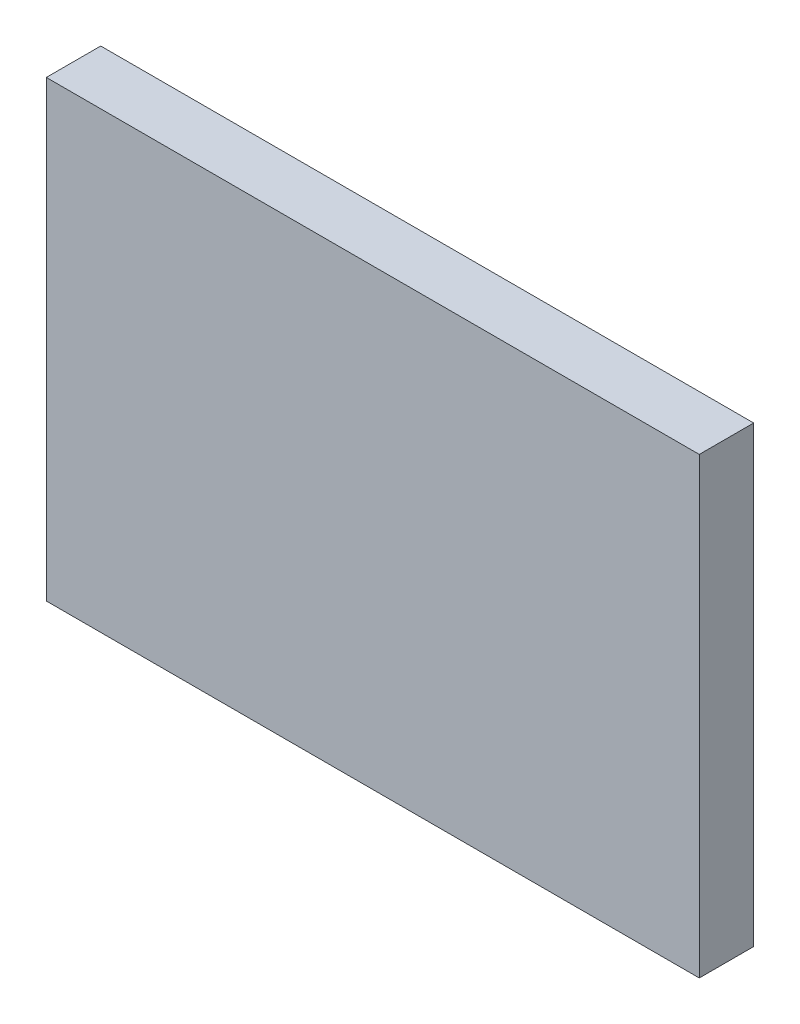
ISO-10303-21;
HEADER;
FILE_DESCRIPTION(('STEP AP214'),'2;1');
FILE_NAME('part.step','',(''),(''),'','','');
FILE_SCHEMA(('AUTOMOTIVE_DESIGN { 1 0 10303 214 1 1 1 1 }'));
ENDSEC;
DATA;
#1=APPLICATION_CONTEXT('core data for automotive mechanical design processes');
#2=APPLICATION_PROTOCOL_DEFINITION('international standard','automotive_design',2000,#1);
#3=PRODUCT_CONTEXT('',#1,'mechanical');
#4=PRODUCT('Part','Part','',(#3));
#5=PRODUCT_RELATED_PRODUCT_CATEGORY('part','',(#4));
#6=PRODUCT_DEFINITION_FORMATION('','',#4);
#7=PRODUCT_DEFINITION_CONTEXT('part definition',#1,'design');
#8=PRODUCT_DEFINITION('design','',#6,#7);
#9=PRODUCT_DEFINITION_SHAPE('','',#8);
#10=(LENGTH_UNIT() NAMED_UNIT(*) SI_UNIT(.MILLI.,.METRE.));
#11=(NAMED_UNIT(*) PLANE_ANGLE_UNIT() SI_UNIT($,.RADIAN.));
#12=(NAMED_UNIT(*) SI_UNIT($,.STERADIAN.) SOLID_ANGLE_UNIT());
#13=UNCERTAINTY_MEASURE_WITH_UNIT(LENGTH_MEASURE(1.E-05),#10,'distance_accuracy_value','');
#14=(GEOMETRIC_REPRESENTATION_CONTEXT(3) GLOBAL_UNCERTAINTY_ASSIGNED_CONTEXT((#13)) GLOBAL_UNIT_ASSIGNED_CONTEXT((#10,
#11,#12)) REPRESENTATION_CONTEXT('',''));
#15=CARTESIAN_POINT('',(0.,0.,0.));
#16=DIRECTION('',(0.,0.,1.));
#17=DIRECTION('',(1.,0.,0.));
#18=AXIS2_PLACEMENT_3D('',#15,#16,#17);
#19=CARTESIAN_POINT('',(0.,0.,3.));
#20=DIRECTION('',(1.,0.,0.));
#21=DIRECTION('',(0.,1.,0.));
#22=AXIS2_PLACEMENT_3D('',#19,#20,#21);
#23=PLANE('',#22);
#24=DIRECTION('',(0.,-1.,0.));
#25=VECTOR('',#24,1.);
#26=CARTESIAN_POINT('',(0.,0.,0.));
#27=LINE('',#26,#25);
#28=CARTESIAN_POINT('',(0.,0.,0.));
#29=VERTEX_POINT('',#28);
#30=CARTESIAN_POINT('',(0.,-25.,0.));
#31=VERTEX_POINT('',#30);
#32=EDGE_CURVE('E126',#29,#31,#27,.T.);
#33=ORIENTED_EDGE('',*,*,#32,.T.);
#34=DIRECTION('',(0.,0.,-1.));
#35=VECTOR('',#34,1.);
#36=CARTESIAN_POINT('',(0.,-25.,3.));
#37=LINE('',#36,#35);
#38=CARTESIAN_POINT('',(0.,-25.,3.));
#39=VERTEX_POINT('',#38);
#40=EDGE_CURVE('E12',#39,#31,#37,.T.);
#41=ORIENTED_EDGE('',*,*,#40,.F.);
#42=DIRECTION('',(0.,-1.,0.));
#43=VECTOR('',#42,1.);
#44=CARTESIAN_POINT('',(0.,0.,3.));
#45=LINE('',#44,#43);
#46=CARTESIAN_POINT('',(0.,0.,3.));
#47=VERTEX_POINT('',#46);
#48=EDGE_CURVE('E95',#47,#39,#45,.T.);
#49=ORIENTED_EDGE('',*,*,#48,.F.);
#50=DIRECTION('',(0.,0.,-1.));
#51=VECTOR('',#50,1.);
#52=CARTESIAN_POINT('',(0.,0.,3.));
#53=LINE('',#52,#51);
#54=EDGE_CURVE('E106',#47,#29,#53,.T.);
#55=ORIENTED_EDGE('',*,*,#54,.T.);
#56=EDGE_LOOP('',(#33,#41,#49,#55));
#57=FACE_BOUND('',#56,.T.);
#58=ADVANCED_FACE('F44',(#57),#23,.F.);
#59=CARTESIAN_POINT('',(0.,-25.,3.));
#60=DIRECTION('',(0.,1.,0.));
#61=DIRECTION('',(0.,0.,1.));
#62=AXIS2_PLACEMENT_3D('',#59,#60,#61);
#63=PLANE('',#62);
#64=DIRECTION('',(1.,0.,0.));
#65=VECTOR('',#64,1.);
#66=CARTESIAN_POINT('',(0.,-25.,0.));
#67=LINE('',#66,#65);
#68=CARTESIAN_POINT('',(36.,-25.,0.));
#69=VERTEX_POINT('',#68);
#70=EDGE_CURVE('E100',#31,#69,#67,.T.);
#71=ORIENTED_EDGE('',*,*,#70,.T.);
#72=DIRECTION('',(0.,0.,-1.));
#73=VECTOR('',#72,1.);
#74=CARTESIAN_POINT('',(36.,-25.,3.));
#75=LINE('',#74,#73);
#76=CARTESIAN_POINT('',(36.,-25.,3.));
#77=VERTEX_POINT('',#76);
#78=EDGE_CURVE('E52',#77,#69,#75,.T.);
#79=ORIENTED_EDGE('',*,*,#78,.F.);
#80=DIRECTION('',(1.,0.,0.));
#81=VECTOR('',#80,1.);
#82=CARTESIAN_POINT('',(0.,-25.,3.));
#83=LINE('',#82,#81);
#84=EDGE_CURVE('E90',#39,#77,#83,.T.);
#85=ORIENTED_EDGE('',*,*,#84,.F.);
#86=ORIENTED_EDGE('',*,*,#40,.T.);
#87=EDGE_LOOP('',(#71,#79,#85,#86));
#88=FACE_BOUND('',#87,.T.);
#89=ADVANCED_FACE('F99',(#88),#63,.F.);
#90=CARTESIAN_POINT('',(36.,0.,3.));
#91=DIRECTION('',(-1.,0.,0.));
#92=DIRECTION('',(0.,0.,1.));
#93=AXIS2_PLACEMENT_3D('',#90,#91,#92);
#94=PLANE('',#93);
#95=DIRECTION('',(0.,1.,0.));
#96=VECTOR('',#95,1.);
#97=CARTESIAN_POINT('',(36.,0.,0.));
#98=LINE('',#97,#96);
#99=CARTESIAN_POINT('',(36.,0.,0.));
#100=VERTEX_POINT('',#99);
#101=EDGE_CURVE('E77',#69,#100,#98,.T.);
#102=ORIENTED_EDGE('',*,*,#101,.T.);
#103=DIRECTION('',(0.,0.,-1.));
#104=VECTOR('',#103,1.);
#105=CARTESIAN_POINT('',(36.,0.,3.));
#106=LINE('',#105,#104);
#107=CARTESIAN_POINT('',(36.,0.,3.));
#108=VERTEX_POINT('',#107);
#109=EDGE_CURVE('E101',#108,#100,#106,.T.);
#110=ORIENTED_EDGE('',*,*,#109,.F.);
#111=DIRECTION('',(0.,1.,0.));
#112=VECTOR('',#111,1.);
#113=CARTESIAN_POINT('',(36.,0.,3.));
#114=LINE('',#113,#112);
#115=EDGE_CURVE('E93',#77,#108,#114,.T.);
#116=ORIENTED_EDGE('',*,*,#115,.F.);
#117=ORIENTED_EDGE('',*,*,#78,.T.);
#118=EDGE_LOOP('',(#102,#110,#116,#117));
#119=FACE_BOUND('',#118,.T.);
#120=ADVANCED_FACE('F102',(#119),#94,.F.);
#121=CARTESIAN_POINT('',(0.,0.,3.));
#122=DIRECTION('',(0.,-1.,0.));
#123=DIRECTION('',(0.,0.,-1.));
#124=AXIS2_PLACEMENT_3D('',#121,#122,#123);
#125=PLANE('',#124);
#126=DIRECTION('',(-1.,0.,0.));
#127=VECTOR('',#126,1.);
#128=CARTESIAN_POINT('',(0.,0.,0.));
#129=LINE('',#128,#127);
#130=EDGE_CURVE('E83',#100,#29,#129,.T.);
#131=ORIENTED_EDGE('',*,*,#130,.T.);
#132=ORIENTED_EDGE('',*,*,#54,.F.);
#133=DIRECTION('',(-1.,0.,0.));
#134=VECTOR('',#133,1.);
#135=CARTESIAN_POINT('',(0.,0.,3.));
#136=LINE('',#135,#134);
#137=EDGE_CURVE('E60',#108,#47,#136,.T.);
#138=ORIENTED_EDGE('',*,*,#137,.F.);
#139=ORIENTED_EDGE('',*,*,#109,.T.);
#140=EDGE_LOOP('',(#131,#132,#138,#139));
#141=FACE_BOUND('',#140,.T.);
#142=ADVANCED_FACE('F121',(#141),#125,.F.);
#143=CARTESIAN_POINT('',(0.,0.,3.));
#144=DIRECTION('',(0.,0.,1.));
#145=DIRECTION('',(1.,0.,0.));
#146=AXIS2_PLACEMENT_3D('',#143,#144,#145);
#147=PLANE('',#146);
#148=ORIENTED_EDGE('',*,*,#48,.T.);
#149=ORIENTED_EDGE('',*,*,#84,.T.);
#150=ORIENTED_EDGE('',*,*,#115,.T.);
#151=ORIENTED_EDGE('',*,*,#137,.T.);
#152=EDGE_LOOP('',(#148,#149,#150,#151));
#153=FACE_BOUND('',#152,.T.);
#154=ADVANCED_FACE('F91',(#153),#147,.T.);
#155=CARTESIAN_POINT('',(0.,0.,0.));
#156=DIRECTION('',(0.,0.,1.));
#157=DIRECTION('',(1.,0.,0.));
#158=AXIS2_PLACEMENT_3D('',#155,#156,#157);
#159=PLANE('',#158);
#160=ORIENTED_EDGE('',*,*,#32,.F.);
#161=ORIENTED_EDGE('',*,*,#130,.F.);
#162=ORIENTED_EDGE('',*,*,#101,.F.);
#163=ORIENTED_EDGE('',*,*,#70,.F.);
#164=EDGE_LOOP('',(#160,#161,#162,#163));
#165=FACE_BOUND('',#164,.T.);
#166=ADVANCED_FACE('F124',(#165),#159,.F.);
#167=CLOSED_SHELL('',(#58,#89,#120,#142,#154,#166));
#168=MANIFOLD_SOLID_BREP('B2',#167);
#169=ADVANCED_BREP_SHAPE_REPRESENTATION('',(#18,#168),#14);
#170=SHAPE_DEFINITION_REPRESENTATION(#9,#169);
ENDSEC;
END-ISO-10303-21;
